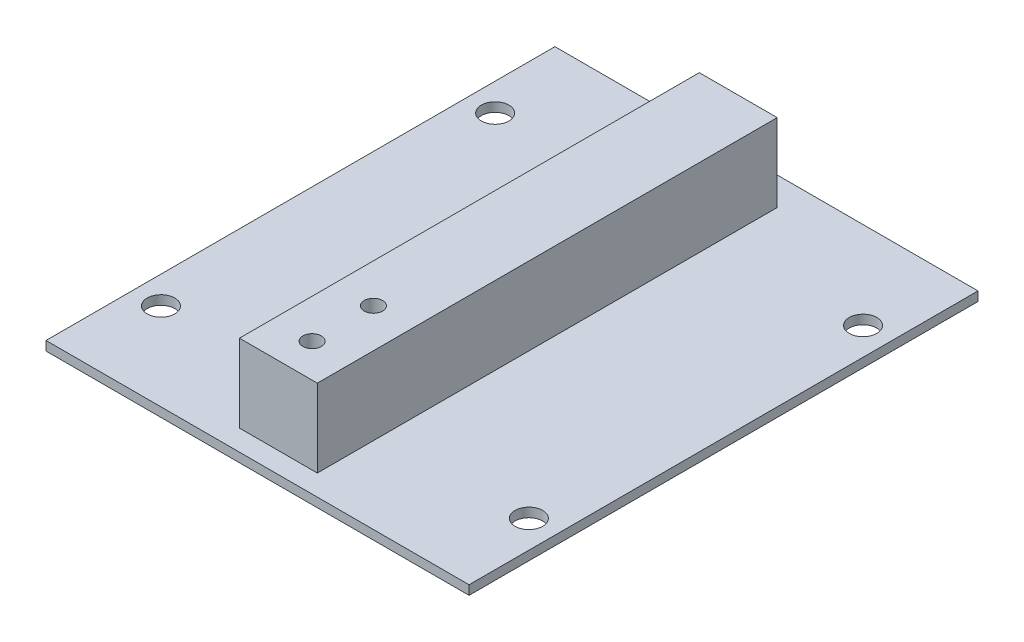
ISO-10303-21;
HEADER;
FILE_DESCRIPTION(('STEP AP214'),'2;1');
FILE_NAME('part.step','',(''),(''),'','','');
FILE_SCHEMA(('AUTOMOTIVE_DESIGN { 1 0 10303 214 1 1 1 1 }'));
ENDSEC;
DATA;
#1=APPLICATION_CONTEXT('core data for automotive mechanical design processes');
#2=APPLICATION_PROTOCOL_DEFINITION('international standard','automotive_design',2000,#1);
#3=PRODUCT_CONTEXT('',#1,'mechanical');
#4=PRODUCT('Part','Part','',(#3));
#5=PRODUCT_RELATED_PRODUCT_CATEGORY('part','',(#4));
#6=PRODUCT_DEFINITION_FORMATION('','',#4);
#7=PRODUCT_DEFINITION_CONTEXT('part definition',#1,'design');
#8=PRODUCT_DEFINITION('design','',#6,#7);
#9=PRODUCT_DEFINITION_SHAPE('','',#8);
#10=(LENGTH_UNIT() NAMED_UNIT(*) SI_UNIT(.MILLI.,.METRE.));
#11=(NAMED_UNIT(*) PLANE_ANGLE_UNIT() SI_UNIT($,.RADIAN.));
#12=(NAMED_UNIT(*) SI_UNIT($,.STERADIAN.) SOLID_ANGLE_UNIT());
#13=UNCERTAINTY_MEASURE_WITH_UNIT(LENGTH_MEASURE(1.E-05),#10,'distance_accuracy_value','');
#14=(GEOMETRIC_REPRESENTATION_CONTEXT(3) GLOBAL_UNCERTAINTY_ASSIGNED_CONTEXT((#13)) GLOBAL_UNIT_ASSIGNED_CONTEXT((#10,
#11,#12)) REPRESENTATION_CONTEXT('',''));
#15=CARTESIAN_POINT('',(0.,0.,0.));
#16=DIRECTION('',(0.,0.,1.));
#17=DIRECTION('',(1.,0.,0.));
#18=AXIS2_PLACEMENT_3D('',#15,#16,#17);
#19=CARTESIAN_POINT('',(0.,1.5,0.));
#20=DIRECTION('',(0.,-1.,0.));
#21=DIRECTION('',(0.,0.,-1.));
#22=AXIS2_PLACEMENT_3D('',#19,#20,#21);
#23=PLANE('',#22);
#24=DIRECTION('',(0.,0.,1.));
#25=VECTOR('',#24,1.);
#26=CARTESIAN_POINT('',(28.15,1.5,-3.40000000000003));
#27=LINE('',#26,#25);
#28=CARTESIAN_POINT('',(28.15,1.5,-78.4));
#29=VERTEX_POINT('',#28);
#30=CARTESIAN_POINT('',(28.15,1.5,-3.40000000000003));
#31=VERTEX_POINT('',#30);
#32=EDGE_CURVE('E49',#29,#31,#27,.T.);
#33=ORIENTED_EDGE('',*,*,#32,.F.);
#34=DIRECTION('',(-1.,0.,0.));
#35=VECTOR('',#34,1.);
#36=CARTESIAN_POINT('',(28.15,1.5,-78.4));
#37=LINE('',#36,#35);
#38=CARTESIAN_POINT('',(40.85,1.5,-78.4));
#39=VERTEX_POINT('',#38);
#40=EDGE_CURVE('E53',#39,#29,#37,.T.);
#41=ORIENTED_EDGE('',*,*,#40,.F.);
#42=DIRECTION('',(0.,0.,-1.));
#43=VECTOR('',#42,1.);
#44=CARTESIAN_POINT('',(40.85,1.5,-3.40000000000003));
#45=LINE('',#44,#43);
#46=CARTESIAN_POINT('',(40.85,1.5,-3.40000000000003));
#47=VERTEX_POINT('',#46);
#48=EDGE_CURVE('E239',#47,#39,#45,.T.);
#49=ORIENTED_EDGE('',*,*,#48,.F.);
#50=DIRECTION('',(1.,0.,0.));
#51=VECTOR('',#50,1.);
#52=CARTESIAN_POINT('',(28.15,1.5,-3.40000000000003));
#53=LINE('',#52,#51);
#54=EDGE_CURVE('E237',#31,#47,#53,.T.);
#55=ORIENTED_EDGE('',*,*,#54,.F.);
#56=EDGE_LOOP('',(#33,#41,#49,#55));
#57=FACE_BOUND('',#56,.T.);
#58=DIRECTION('',(0.,0.,1.));
#59=VECTOR('',#58,1.);
#60=CARTESIAN_POINT('',(0.,1.5,0.));
#61=LINE('',#60,#59);
#62=CARTESIAN_POINT('',(0.,1.5,-83.));
#63=VERTEX_POINT('',#62);
#64=CARTESIAN_POINT('',(0.,1.5,0.));
#65=VERTEX_POINT('',#64);
#66=EDGE_CURVE('E150',#63,#65,#61,.T.);
#67=ORIENTED_EDGE('',*,*,#66,.T.);
#68=DIRECTION('',(1.,0.,0.));
#69=VECTOR('',#68,1.);
#70=CARTESIAN_POINT('',(0.,1.5,0.));
#71=LINE('',#70,#69);
#72=CARTESIAN_POINT('',(69.,1.5,0.));
#73=VERTEX_POINT('',#72);
#74=EDGE_CURVE('E153',#65,#73,#71,.T.);
#75=ORIENTED_EDGE('',*,*,#74,.T.);
#76=DIRECTION('',(0.,0.,-1.));
#77=VECTOR('',#76,1.);
#78=CARTESIAN_POINT('',(69.,1.5,0.));
#79=LINE('',#78,#77);
#80=CARTESIAN_POINT('',(69.,1.5,-83.));
#81=VERTEX_POINT('',#80);
#82=EDGE_CURVE('E156',#73,#81,#79,.T.);
#83=ORIENTED_EDGE('',*,*,#82,.T.);
#84=DIRECTION('',(-1.,0.,0.));
#85=VECTOR('',#84,1.);
#86=CARTESIAN_POINT('',(0.,1.5,-83.));
#87=LINE('',#86,#85);
#88=EDGE_CURVE('E158',#81,#63,#87,.T.);
#89=ORIENTED_EDGE('',*,*,#88,.T.);
#90=EDGE_LOOP('',(#67,#75,#83,#89));
#91=FACE_BOUND('',#90,.T.);
#92=CARTESIAN_POINT('',(4.5,1.5,-68.75));
#93=DIRECTION('',(0.,1.,0.));
#94=DIRECTION('',(0.,0.,1.));
#95=AXIS2_PLACEMENT_3D('',#92,#93,#94);
#96=CIRCLE('',#95,2.25);
#97=CARTESIAN_POINT('',(4.5,1.5,-66.5));
#98=VERTEX_POINT('',#97);
#99=EDGE_CURVE('E144',#98,#98,#96,.T.);
#100=ORIENTED_EDGE('',*,*,#99,.F.);
#101=EDGE_LOOP('',(#100));
#102=FACE_BOUND('',#101,.T.);
#103=CARTESIAN_POINT('',(64.5,1.5,-68.75));
#104=DIRECTION('',(0.,1.,0.));
#105=DIRECTION('',(0.,0.,1.));
#106=AXIS2_PLACEMENT_3D('',#103,#104,#105);
#107=CIRCLE('',#106,2.25);
#108=CARTESIAN_POINT('',(64.5,1.5,-66.5));
#109=VERTEX_POINT('',#108);
#110=EDGE_CURVE('E138',#109,#109,#107,.T.);
#111=ORIENTED_EDGE('',*,*,#110,.F.);
#112=EDGE_LOOP('',(#111));
#113=FACE_BOUND('',#112,.T.);
#114=CARTESIAN_POINT('',(64.5,1.5,-14.25));
#115=DIRECTION('',(0.,1.,0.));
#116=DIRECTION('',(0.,0.,1.));
#117=AXIS2_PLACEMENT_3D('',#114,#115,#116);
#118=CIRCLE('',#117,2.24999999999999);
#119=CARTESIAN_POINT('',(64.5,1.5,-12.));
#120=VERTEX_POINT('',#119);
#121=EDGE_CURVE('E132',#120,#120,#118,.T.);
#122=ORIENTED_EDGE('',*,*,#121,.F.);
#123=EDGE_LOOP('',(#122));
#124=FACE_BOUND('',#123,.T.);
#125=CARTESIAN_POINT('',(4.49999999999999,1.5,-14.25));
#126=DIRECTION('',(0.,1.,0.));
#127=DIRECTION('',(0.,0.,1.));
#128=AXIS2_PLACEMENT_3D('',#125,#126,#127);
#129=CIRCLE('',#128,2.25);
#130=CARTESIAN_POINT('',(4.49999999999999,1.5,-12.));
#131=VERTEX_POINT('',#130);
#132=EDGE_CURVE('E123',#131,#131,#129,.T.);
#133=ORIENTED_EDGE('',*,*,#132,.F.);
#134=EDGE_LOOP('',(#133));
#135=FACE_BOUND('',#134,.T.);
#136=ADVANCED_FACE('F34',(#57,#91,#102,#113,#124,#135),#23,.F.);
#137=CARTESIAN_POINT('',(0.,0.,0.));
#138=DIRECTION('',(0.,-1.,0.));
#139=DIRECTION('',(0.,0.,-1.));
#140=AXIS2_PLACEMENT_3D('',#137,#138,#139);
#141=PLANE('',#140);
#142=CARTESIAN_POINT('',(64.5,0.,-14.25));
#143=DIRECTION('',(0.,1.,0.));
#144=DIRECTION('',(0.,0.,1.));
#145=AXIS2_PLACEMENT_3D('',#142,#143,#144);
#146=CIRCLE('',#145,2.24999999999999);
#147=CARTESIAN_POINT('',(64.5,0.,-12.));
#148=VERTEX_POINT('',#147);
#149=EDGE_CURVE('E130',#148,#148,#146,.T.);
#150=ORIENTED_EDGE('',*,*,#149,.T.);
#151=EDGE_LOOP('',(#150));
#152=FACE_BOUND('',#151,.T.);
#153=CARTESIAN_POINT('',(4.5,0.,-68.75));
#154=DIRECTION('',(0.,1.,0.));
#155=DIRECTION('',(0.,0.,1.));
#156=AXIS2_PLACEMENT_3D('',#153,#154,#155);
#157=CIRCLE('',#156,2.25);
#158=CARTESIAN_POINT('',(4.5,0.,-66.5));
#159=VERTEX_POINT('',#158);
#160=EDGE_CURVE('E141',#159,#159,#157,.T.);
#161=ORIENTED_EDGE('',*,*,#160,.T.);
#162=EDGE_LOOP('',(#161));
#163=FACE_BOUND('',#162,.T.);
#164=DIRECTION('',(0.,0.,1.));
#165=VECTOR('',#164,1.);
#166=CARTESIAN_POINT('',(0.,0.,0.));
#167=LINE('',#166,#165);
#168=CARTESIAN_POINT('',(0.,0.,-83.));
#169=VERTEX_POINT('',#168);
#170=CARTESIAN_POINT('',(0.,0.,0.));
#171=VERTEX_POINT('',#170);
#172=EDGE_CURVE('E147',#169,#171,#167,.T.);
#173=ORIENTED_EDGE('',*,*,#172,.F.);
#174=DIRECTION('',(-1.,0.,0.));
#175=VECTOR('',#174,1.);
#176=CARTESIAN_POINT('',(0.,0.,-83.));
#177=LINE('',#176,#175);
#178=CARTESIAN_POINT('',(69.,0.,-83.));
#179=VERTEX_POINT('',#178);
#180=EDGE_CURVE('E154',#179,#169,#177,.T.);
#181=ORIENTED_EDGE('',*,*,#180,.F.);
#182=DIRECTION('',(0.,0.,-1.));
#183=VECTOR('',#182,1.);
#184=CARTESIAN_POINT('',(69.,0.,0.));
#185=LINE('',#184,#183);
#186=CARTESIAN_POINT('',(69.,0.,0.));
#187=VERTEX_POINT('',#186);
#188=EDGE_CURVE('E165',#187,#179,#185,.T.);
#189=ORIENTED_EDGE('',*,*,#188,.F.);
#190=DIRECTION('',(1.,0.,0.));
#191=VECTOR('',#190,1.);
#192=CARTESIAN_POINT('',(0.,0.,0.));
#193=LINE('',#192,#191);
#194=EDGE_CURVE('E163',#171,#187,#193,.T.);
#195=ORIENTED_EDGE('',*,*,#194,.F.);
#196=EDGE_LOOP('',(#173,#181,#189,#195));
#197=FACE_BOUND('',#196,.T.);
#198=CARTESIAN_POINT('',(64.5,0.,-68.75));
#199=DIRECTION('',(0.,1.,0.));
#200=DIRECTION('',(0.,0.,1.));
#201=AXIS2_PLACEMENT_3D('',#198,#199,#200);
#202=CIRCLE('',#201,2.25);
#203=CARTESIAN_POINT('',(64.5,0.,-66.5));
#204=VERTEX_POINT('',#203);
#205=EDGE_CURVE('E135',#204,#204,#202,.T.);
#206=ORIENTED_EDGE('',*,*,#205,.T.);
#207=EDGE_LOOP('',(#206));
#208=FACE_BOUND('',#207,.T.);
#209=CARTESIAN_POINT('',(4.49999999999999,0.,-14.25));
#210=DIRECTION('',(0.,1.,0.));
#211=DIRECTION('',(0.,0.,1.));
#212=AXIS2_PLACEMENT_3D('',#209,#210,#211);
#213=CIRCLE('',#212,2.25);
#214=CARTESIAN_POINT('',(4.49999999999999,0.,-12.));
#215=VERTEX_POINT('',#214);
#216=EDGE_CURVE('E120',#215,#215,#213,.T.);
#217=ORIENTED_EDGE('',*,*,#216,.T.);
#218=EDGE_LOOP('',(#217));
#219=FACE_BOUND('',#218,.T.);
#220=ADVANCED_FACE('F183',(#152,#163,#197,#208,#219),#141,.T.);
#221=CARTESIAN_POINT('',(0.,1.5,0.));
#222=DIRECTION('',(1.,0.,0.));
#223=DIRECTION('',(0.,0.,-1.));
#224=AXIS2_PLACEMENT_3D('',#221,#222,#223);
#225=PLANE('',#224);
#226=ORIENTED_EDGE('',*,*,#172,.T.);
#227=DIRECTION('',(0.,-1.,0.));
#228=VECTOR('',#227,1.);
#229=CARTESIAN_POINT('',(0.,1.5,0.));
#230=LINE('',#229,#228);
#231=EDGE_CURVE('E11',#65,#171,#230,.T.);
#232=ORIENTED_EDGE('',*,*,#231,.F.);
#233=ORIENTED_EDGE('',*,*,#66,.F.);
#234=DIRECTION('',(0.,-1.,0.));
#235=VECTOR('',#234,1.);
#236=CARTESIAN_POINT('',(0.,1.5,-83.));
#237=LINE('',#236,#235);
#238=EDGE_CURVE('E160',#63,#169,#237,.T.);
#239=ORIENTED_EDGE('',*,*,#238,.T.);
#240=EDGE_LOOP('',(#226,#232,#233,#239));
#241=FACE_BOUND('',#240,.T.);
#242=ADVANCED_FACE('F36',(#241),#225,.F.);
#243=CARTESIAN_POINT('',(0.,1.5,0.));
#244=DIRECTION('',(0.,0.,-1.));
#245=DIRECTION('',(-1.,0.,0.));
#246=AXIS2_PLACEMENT_3D('',#243,#244,#245);
#247=PLANE('',#246);
#248=ORIENTED_EDGE('',*,*,#194,.T.);
#249=DIRECTION('',(0.,-1.,0.));
#250=VECTOR('',#249,1.);
#251=CARTESIAN_POINT('',(69.,1.5,0.));
#252=LINE('',#251,#250);
#253=EDGE_CURVE('E42',#73,#187,#252,.T.);
#254=ORIENTED_EDGE('',*,*,#253,.F.);
#255=ORIENTED_EDGE('',*,*,#74,.F.);
#256=ORIENTED_EDGE('',*,*,#231,.T.);
#257=EDGE_LOOP('',(#248,#254,#255,#256));
#258=FACE_BOUND('',#257,.T.);
#259=ADVANCED_FACE('F194',(#258),#247,.F.);
#260=CARTESIAN_POINT('',(69.,1.5,0.));
#261=DIRECTION('',(-1.,0.,0.));
#262=DIRECTION('',(0.,0.,1.));
#263=AXIS2_PLACEMENT_3D('',#260,#261,#262);
#264=PLANE('',#263);
#265=ORIENTED_EDGE('',*,*,#188,.T.);
#266=DIRECTION('',(0.,-1.,0.));
#267=VECTOR('',#266,1.);
#268=CARTESIAN_POINT('',(69.,1.5,-83.));
#269=LINE('',#268,#267);
#270=EDGE_CURVE('E170',#81,#179,#269,.T.);
#271=ORIENTED_EDGE('',*,*,#270,.F.);
#272=ORIENTED_EDGE('',*,*,#82,.F.);
#273=ORIENTED_EDGE('',*,*,#253,.T.);
#274=EDGE_LOOP('',(#265,#271,#272,#273));
#275=FACE_BOUND('',#274,.T.);
#276=ADVANCED_FACE('F177',(#275),#264,.F.);
#277=CARTESIAN_POINT('',(0.,1.5,-83.));
#278=DIRECTION('',(0.,0.,1.));
#279=DIRECTION('',(1.,0.,0.));
#280=AXIS2_PLACEMENT_3D('',#277,#278,#279);
#281=PLANE('',#280);
#282=ORIENTED_EDGE('',*,*,#180,.T.);
#283=ORIENTED_EDGE('',*,*,#238,.F.);
#284=ORIENTED_EDGE('',*,*,#88,.F.);
#285=ORIENTED_EDGE('',*,*,#270,.T.);
#286=EDGE_LOOP('',(#282,#283,#284,#285));
#287=FACE_BOUND('',#286,.T.);
#288=ADVANCED_FACE('F187',(#287),#281,.F.);
#289=CARTESIAN_POINT('',(4.5,1.5,-68.75));
#290=DIRECTION('',(0.,-1.,0.));
#291=DIRECTION('',(0.,0.,-1.));
#292=AXIS2_PLACEMENT_3D('',#289,#290,#291);
#293=CYLINDRICAL_SURFACE('',#292,2.25);
#294=ORIENTED_EDGE('',*,*,#99,.T.);
#295=EDGE_LOOP('',(#294));
#296=FACE_BOUND('',#295,.T.);
#297=ORIENTED_EDGE('',*,*,#160,.F.);
#298=EDGE_LOOP('',(#297));
#299=FACE_BOUND('',#298,.T.);
#300=ADVANCED_FACE('F271',(#296,#299),#293,.F.);
#301=CARTESIAN_POINT('',(64.5,1.5,-68.75));
#302=DIRECTION('',(0.,-1.,0.));
#303=DIRECTION('',(0.,0.,-1.));
#304=AXIS2_PLACEMENT_3D('',#301,#302,#303);
#305=CYLINDRICAL_SURFACE('',#304,2.25);
#306=ORIENTED_EDGE('',*,*,#110,.T.);
#307=EDGE_LOOP('',(#306));
#308=FACE_BOUND('',#307,.T.);
#309=ORIENTED_EDGE('',*,*,#205,.F.);
#310=EDGE_LOOP('',(#309));
#311=FACE_BOUND('',#310,.T.);
#312=ADVANCED_FACE('F268',(#308,#311),#305,.F.);
#313=CARTESIAN_POINT('',(64.5,1.5,-14.25));
#314=DIRECTION('',(0.,-1.,0.));
#315=DIRECTION('',(0.,0.,-1.));
#316=AXIS2_PLACEMENT_3D('',#313,#314,#315);
#317=CYLINDRICAL_SURFACE('',#316,2.24999999999999);
#318=ORIENTED_EDGE('',*,*,#121,.T.);
#319=EDGE_LOOP('',(#318));
#320=FACE_BOUND('',#319,.T.);
#321=ORIENTED_EDGE('',*,*,#149,.F.);
#322=EDGE_LOOP('',(#321));
#323=FACE_BOUND('',#322,.T.);
#324=ADVANCED_FACE('F264',(#320,#323),#317,.F.);
#325=CARTESIAN_POINT('',(4.49999999999999,1.5,-14.25));
#326=DIRECTION('',(0.,-1.,0.));
#327=DIRECTION('',(0.,0.,-1.));
#328=AXIS2_PLACEMENT_3D('',#325,#326,#327);
#329=CYLINDRICAL_SURFACE('',#328,2.25);
#330=ORIENTED_EDGE('',*,*,#132,.T.);
#331=EDGE_LOOP('',(#330));
#332=FACE_BOUND('',#331,.T.);
#333=ORIENTED_EDGE('',*,*,#216,.F.);
#334=EDGE_LOOP('',(#333));
#335=FACE_BOUND('',#334,.T.);
#336=ADVANCED_FACE('F261',(#332,#335),#329,.F.);
#337=CARTESIAN_POINT('',(0.,14.2,0.));
#338=DIRECTION('',(0.,-1.,0.));
#339=DIRECTION('',(0.,0.,-1.));
#340=AXIS2_PLACEMENT_3D('',#337,#338,#339);
#341=PLANE('',#340);
#342=DIRECTION('',(0.,0.,1.));
#343=VECTOR('',#342,1.);
#344=CARTESIAN_POINT('',(28.15,14.2,-3.40000000000003));
#345=LINE('',#344,#343);
#346=CARTESIAN_POINT('',(28.15,14.2,-78.4));
#347=VERTEX_POINT('',#346);
#348=CARTESIAN_POINT('',(28.15,14.2,-3.40000000000003));
#349=VERTEX_POINT('',#348);
#350=EDGE_CURVE('E108',#347,#349,#345,.T.);
#351=ORIENTED_EDGE('',*,*,#350,.T.);
#352=DIRECTION('',(1.,0.,0.));
#353=VECTOR('',#352,1.);
#354=CARTESIAN_POINT('',(28.15,14.2,-3.40000000000003));
#355=LINE('',#354,#353);
#356=CARTESIAN_POINT('',(40.85,14.2,-3.40000000000003));
#357=VERTEX_POINT('',#356);
#358=EDGE_CURVE('E97',#349,#357,#355,.T.);
#359=ORIENTED_EDGE('',*,*,#358,.T.);
#360=DIRECTION('',(0.,0.,-1.));
#361=VECTOR('',#360,1.);
#362=CARTESIAN_POINT('',(40.85,14.2,-3.40000000000003));
#363=LINE('',#362,#361);
#364=CARTESIAN_POINT('',(40.85,14.2,-78.4));
#365=VERTEX_POINT('',#364);
#366=EDGE_CURVE('E107',#357,#365,#363,.T.);
#367=ORIENTED_EDGE('',*,*,#366,.T.);
#368=DIRECTION('',(-1.,0.,0.));
#369=VECTOR('',#368,1.);
#370=CARTESIAN_POINT('',(28.15,14.2,-78.4));
#371=LINE('',#370,#369);
#372=EDGE_CURVE('E114',#365,#347,#371,.T.);
#373=ORIENTED_EDGE('',*,*,#372,.T.);
#374=EDGE_LOOP('',(#351,#359,#367,#373));
#375=FACE_BOUND('',#374,.T.);
#376=CARTESIAN_POINT('',(34.5,14.2,-8.90000000000003));
#377=DIRECTION('',(0.,1.,0.));
#378=DIRECTION('',(0.,0.,1.));
#379=AXIS2_PLACEMENT_3D('',#376,#377,#378);
#380=CIRCLE('',#379,1.5);
#381=CARTESIAN_POINT('',(34.5,14.2,-7.40000000000002));
#382=VERTEX_POINT('',#381);
#383=EDGE_CURVE('E228',#382,#382,#380,.T.);
#384=ORIENTED_EDGE('',*,*,#383,.F.);
#385=EDGE_LOOP('',(#384));
#386=FACE_BOUND('',#385,.T.);
#387=CARTESIAN_POINT('',(34.5,14.2,-18.9));
#388=DIRECTION('',(0.,1.,0.));
#389=DIRECTION('',(0.,0.,1.));
#390=AXIS2_PLACEMENT_3D('',#387,#388,#389);
#391=CIRCLE('',#390,1.5);
#392=CARTESIAN_POINT('',(34.5,14.2,-17.4));
#393=VERTEX_POINT('',#392);
#394=EDGE_CURVE('E222',#393,#393,#391,.T.);
#395=ORIENTED_EDGE('',*,*,#394,.F.);
#396=EDGE_LOOP('',(#395));
#397=FACE_BOUND('',#396,.T.);
#398=ADVANCED_FACE('F111',(#375,#386,#397),#341,.F.);
#399=CARTESIAN_POINT('',(28.15,14.2,-3.40000000000003));
#400=DIRECTION('',(1.,0.,0.));
#401=DIRECTION('',(0.,0.,-1.));
#402=AXIS2_PLACEMENT_3D('',#399,#400,#401);
#403=PLANE('',#402);
#404=ORIENTED_EDGE('',*,*,#32,.T.);
#405=DIRECTION('',(0.,-1.,0.));
#406=VECTOR('',#405,1.);
#407=CARTESIAN_POINT('',(28.15,14.2,-3.40000000000003));
#408=LINE('',#407,#406);
#409=EDGE_CURVE('E102',#349,#31,#408,.T.);
#410=ORIENTED_EDGE('',*,*,#409,.F.);
#411=ORIENTED_EDGE('',*,*,#350,.F.);
#412=DIRECTION('',(0.,-1.,0.));
#413=VECTOR('',#412,1.);
#414=CARTESIAN_POINT('',(28.15,14.2,-78.4));
#415=LINE('',#414,#413);
#416=EDGE_CURVE('E235',#347,#29,#415,.T.);
#417=ORIENTED_EDGE('',*,*,#416,.T.);
#418=EDGE_LOOP('',(#404,#410,#411,#417));
#419=FACE_BOUND('',#418,.T.);
#420=ADVANCED_FACE('F119',(#419),#403,.F.);
#421=CARTESIAN_POINT('',(28.15,14.2,-3.40000000000003));
#422=DIRECTION('',(0.,0.,-1.));
#423=DIRECTION('',(-1.,0.,0.));
#424=AXIS2_PLACEMENT_3D('',#421,#422,#423);
#425=PLANE('',#424);
#426=ORIENTED_EDGE('',*,*,#54,.T.);
#427=DIRECTION('',(0.,-1.,0.));
#428=VECTOR('',#427,1.);
#429=CARTESIAN_POINT('',(40.85,14.2,-3.40000000000003));
#430=LINE('',#429,#428);
#431=EDGE_CURVE('E104',#357,#47,#430,.T.);
#432=ORIENTED_EDGE('',*,*,#431,.F.);
#433=ORIENTED_EDGE('',*,*,#358,.F.);
#434=ORIENTED_EDGE('',*,*,#409,.T.);
#435=EDGE_LOOP('',(#426,#432,#433,#434));
#436=FACE_BOUND('',#435,.T.);
#437=ADVANCED_FACE('F100',(#436),#425,.F.);
#438=CARTESIAN_POINT('',(40.85,14.2,-3.40000000000003));
#439=DIRECTION('',(-1.,0.,0.));
#440=DIRECTION('',(0.,0.,1.));
#441=AXIS2_PLACEMENT_3D('',#438,#439,#440);
#442=PLANE('',#441);
#443=ORIENTED_EDGE('',*,*,#48,.T.);
#444=DIRECTION('',(0.,-1.,0.));
#445=VECTOR('',#444,1.);
#446=CARTESIAN_POINT('',(40.85,14.2,-78.4));
#447=LINE('',#446,#445);
#448=EDGE_CURVE('E125',#365,#39,#447,.T.);
#449=ORIENTED_EDGE('',*,*,#448,.F.);
#450=ORIENTED_EDGE('',*,*,#366,.F.);
#451=ORIENTED_EDGE('',*,*,#431,.T.);
#452=EDGE_LOOP('',(#443,#449,#450,#451));
#453=FACE_BOUND('',#452,.T.);
#454=ADVANCED_FACE('F247',(#453),#442,.F.);
#455=CARTESIAN_POINT('',(28.15,14.2,-78.4));
#456=DIRECTION('',(0.,0.,1.));
#457=DIRECTION('',(1.,0.,0.));
#458=AXIS2_PLACEMENT_3D('',#455,#456,#457);
#459=PLANE('',#458);
#460=ORIENTED_EDGE('',*,*,#40,.T.);
#461=ORIENTED_EDGE('',*,*,#416,.F.);
#462=ORIENTED_EDGE('',*,*,#372,.F.);
#463=ORIENTED_EDGE('',*,*,#448,.T.);
#464=EDGE_LOOP('',(#460,#461,#462,#463));
#465=FACE_BOUND('',#464,.T.);
#466=ADVANCED_FACE('F245',(#465),#459,.F.);
#467=CARTESIAN_POINT('',(34.5,14.2,-8.90000000000003));
#468=DIRECTION('',(0.,-1.,0.));
#469=DIRECTION('',(0.,0.,-1.));
#470=AXIS2_PLACEMENT_3D('',#467,#468,#469);
#471=CYLINDRICAL_SURFACE('',#470,1.5);
#472=ORIENTED_EDGE('',*,*,#383,.T.);
#473=EDGE_LOOP('',(#472));
#474=FACE_BOUND('',#473,.T.);
#475=CARTESIAN_POINT('',(34.5,1.5,-8.90000000000003));
#476=DIRECTION('',(0.,1.,0.));
#477=DIRECTION('',(0.,0.,1.));
#478=AXIS2_PLACEMENT_3D('',#475,#476,#477);
#479=CIRCLE('',#478,1.5);
#480=CARTESIAN_POINT('',(34.5,1.5,-7.40000000000002));
#481=VERTEX_POINT('',#480);
#482=EDGE_CURVE('E225',#481,#481,#479,.T.);
#483=ORIENTED_EDGE('',*,*,#482,.F.);
#484=EDGE_LOOP('',(#483));
#485=FACE_BOUND('',#484,.T.);
#486=ADVANCED_FACE('F254',(#474,#485),#471,.F.);
#487=CARTESIAN_POINT('',(34.5,14.2,-18.9));
#488=DIRECTION('',(0.,-1.,0.));
#489=DIRECTION('',(0.,0.,-1.));
#490=AXIS2_PLACEMENT_3D('',#487,#488,#489);
#491=CYLINDRICAL_SURFACE('',#490,1.5);
#492=ORIENTED_EDGE('',*,*,#394,.T.);
#493=EDGE_LOOP('',(#492));
#494=FACE_BOUND('',#493,.T.);
#495=CARTESIAN_POINT('',(34.5,1.5,-18.9));
#496=DIRECTION('',(0.,1.,0.));
#497=DIRECTION('',(0.,0.,1.));
#498=AXIS2_PLACEMENT_3D('',#495,#496,#497);
#499=CIRCLE('',#498,1.5);
#500=CARTESIAN_POINT('',(34.5,1.5,-17.4));
#501=VERTEX_POINT('',#500);
#502=EDGE_CURVE('E220',#501,#501,#499,.T.);
#503=ORIENTED_EDGE('',*,*,#502,.F.);
#504=EDGE_LOOP('',(#503));
#505=FACE_BOUND('',#504,.T.);
#506=ADVANCED_FACE('F212',(#494,#505),#491,.F.);
#507=ORIENTED_EDGE('',*,*,#482,.T.);
#508=EDGE_LOOP('',(#507));
#509=FACE_BOUND('',#508,.T.);
#510=ADVANCED_FACE('F203',(#509),#23,.F.);
#511=ORIENTED_EDGE('',*,*,#502,.T.);
#512=EDGE_LOOP('',(#511));
#513=FACE_BOUND('',#512,.T.);
#514=ADVANCED_FACE('F204',(#513),#23,.F.);
#515=CLOSED_SHELL('',(#136,#220,#242,#259,#276,#288,#300,#312,#324,#336,#398,#420,#437,#454,
#466,#486,#506,#510,#514));
#516=MANIFOLD_SOLID_BREP('B2',#515);
#517=ADVANCED_BREP_SHAPE_REPRESENTATION('',(#18,#516),#14);
#518=SHAPE_DEFINITION_REPRESENTATION(#9,#517);
ENDSEC;
END-ISO-10303-21;
